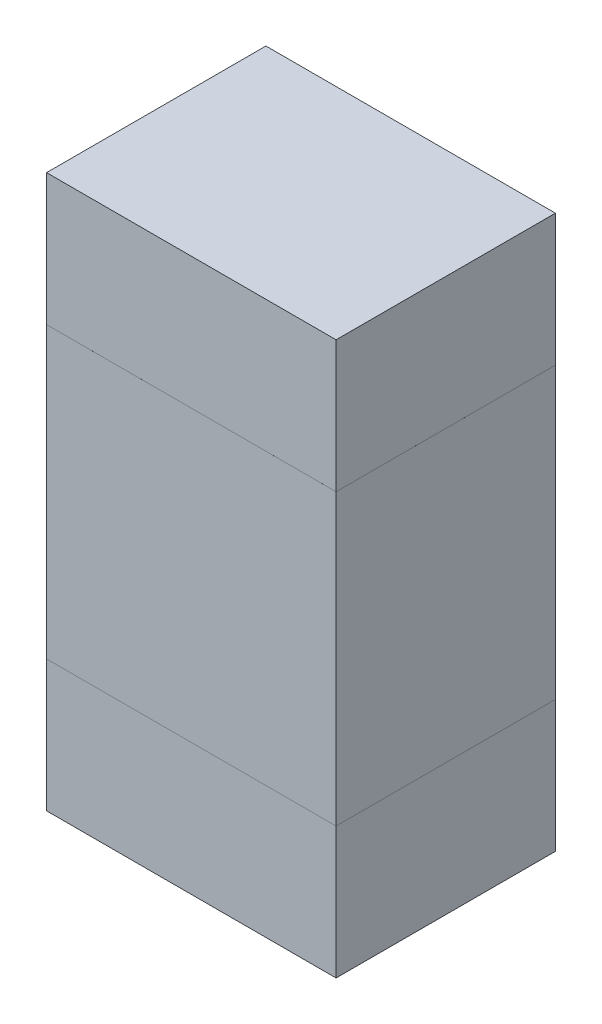
ISO-10303-21;
HEADER;
FILE_DESCRIPTION(('STEP AP214'),'2;1');
FILE_NAME('part.step','',(''),(''),'','','');
FILE_SCHEMA(('AUTOMOTIVE_DESIGN { 1 0 10303 214 1 1 1 1 }'));
ENDSEC;
DATA;
#1=APPLICATION_CONTEXT('core data for automotive mechanical design processes');
#2=APPLICATION_PROTOCOL_DEFINITION('international standard','automotive_design',2000,#1);
#3=PRODUCT_CONTEXT('',#1,'mechanical');
#4=PRODUCT('Part','Part','',(#3));
#5=PRODUCT_RELATED_PRODUCT_CATEGORY('part','',(#4));
#6=PRODUCT_DEFINITION_FORMATION('','',#4);
#7=PRODUCT_DEFINITION_CONTEXT('part definition',#1,'design');
#8=PRODUCT_DEFINITION('design','',#6,#7);
#9=PRODUCT_DEFINITION_SHAPE('','',#8);
#10=(LENGTH_UNIT() NAMED_UNIT(*) SI_UNIT(.MILLI.,.METRE.));
#11=(NAMED_UNIT(*) PLANE_ANGLE_UNIT() SI_UNIT($,.RADIAN.));
#12=(NAMED_UNIT(*) SI_UNIT($,.STERADIAN.) SOLID_ANGLE_UNIT());
#13=UNCERTAINTY_MEASURE_WITH_UNIT(LENGTH_MEASURE(1.E-05),#10,'distance_accuracy_value','');
#14=(GEOMETRIC_REPRESENTATION_CONTEXT(3) GLOBAL_UNCERTAINTY_ASSIGNED_CONTEXT((#13)) GLOBAL_UNIT_ASSIGNED_CONTEXT((#10,
#11,#12)) REPRESENTATION_CONTEXT('',''));
#15=CARTESIAN_POINT('',(0.,0.,0.));
#16=DIRECTION('',(0.,0.,1.));
#17=DIRECTION('',(1.,0.,0.));
#18=AXIS2_PLACEMENT_3D('',#15,#16,#17);
#19=CARTESIAN_POINT('',(5.340002521211,9.010001486074,0.2499995));
#20=DIRECTION('',(0.,0.,-1.));
#21=DIRECTION('',(0.,-1.,0.));
#22=AXIS2_PLACEMENT_3D('',#19,#20,#21);
#23=PLANE('',#22);
#24=DIRECTION('',(0.,1.,0.));
#25=VECTOR('',#24,1.);
#26=CARTESIAN_POINT('',(5.340002521211,9.010001486074,0.2499995));
#27=LINE('',#26,#25);
#28=CARTESIAN_POINT('',(5.340002521211,9.010001486074,0.2499995));
#29=VERTEX_POINT('',#28);
#30=CARTESIAN_POINT('',(5.340002521211,9.339998286074,0.2499995));
#31=VERTEX_POINT('',#30);
#32=EDGE_CURVE('P0_E94',#29,#31,#27,.T.);
#33=ORIENTED_EDGE('',*,*,#32,.T.);
#34=DIRECTION('',(-1.,0.,0.));
#35=VECTOR('',#34,1.);
#36=CARTESIAN_POINT('',(5.340002521211,9.339998286074,0.2499995));
#37=LINE('',#36,#35);
#38=CARTESIAN_POINT('',(5.010008261211,9.339998286074,0.2499995));
#39=VERTEX_POINT('',#38);
#40=EDGE_CURVE('P0_E90',#31,#39,#37,.T.);
#41=ORIENTED_EDGE('',*,*,#40,.T.);
#42=DIRECTION('',(0.,-1.,0.));
#43=VECTOR('',#42,1.);
#44=CARTESIAN_POINT('',(5.010008261211,9.339998286074,0.2499995));
#45=LINE('',#44,#43);
#46=CARTESIAN_POINT('',(5.010008261211,9.010001486074,0.2499995));
#47=VERTEX_POINT('',#46);
#48=EDGE_CURVE('P0_E114',#39,#47,#45,.T.);
#49=ORIENTED_EDGE('',*,*,#48,.T.);
#50=DIRECTION('',(1.,0.,0.));
#51=VECTOR('',#50,1.);
#52=CARTESIAN_POINT('',(5.010008261211,9.010001486074,0.2499995));
#53=LINE('',#52,#51);
#54=EDGE_CURVE('P0_E11',#47,#29,#53,.T.);
#55=ORIENTED_EDGE('',*,*,#54,.T.);
#56=EDGE_LOOP('',(#33,#41,#49,#55));
#57=FACE_BOUND('',#56,.T.);
#58=ADVANCED_FACE('P0_F17',(#57),#23,.F.);
#59=CARTESIAN_POINT('',(5.340002521211,9.010001486074,0.));
#60=DIRECTION('',(0.,0.,-1.));
#61=DIRECTION('',(0.,-1.,0.));
#62=AXIS2_PLACEMENT_3D('',#59,#60,#61);
#63=PLANE('',#62);
#64=DIRECTION('',(1.,0.,0.));
#65=VECTOR('',#64,1.);
#66=CARTESIAN_POINT('',(5.010008261211,9.010001486074,0.));
#67=LINE('',#66,#65);
#68=CARTESIAN_POINT('',(5.010008261211,9.010001486074,0.));
#69=VERTEX_POINT('',#68);
#70=CARTESIAN_POINT('',(5.340002521211,9.010001486074,0.));
#71=VERTEX_POINT('',#70);
#72=EDGE_CURVE('P0_E20',#69,#71,#67,.T.);
#73=ORIENTED_EDGE('',*,*,#72,.F.);
#74=DIRECTION('',(0.,-1.,0.));
#75=VECTOR('',#74,1.);
#76=CARTESIAN_POINT('',(5.010008261211,9.339998286074,0.));
#77=LINE('',#76,#75);
#78=CARTESIAN_POINT('',(5.010008261211,9.339998286074,0.));
#79=VERTEX_POINT('',#78);
#80=EDGE_CURVE('P0_E59',#79,#69,#77,.T.);
#81=ORIENTED_EDGE('',*,*,#80,.F.);
#82=DIRECTION('',(-1.,0.,0.));
#83=VECTOR('',#82,1.);
#84=CARTESIAN_POINT('',(5.340002521211,9.339998286074,0.));
#85=LINE('',#84,#83);
#86=CARTESIAN_POINT('',(5.340002521211,9.339998286074,0.));
#87=VERTEX_POINT('',#86);
#88=EDGE_CURVE('P0_E75',#87,#79,#85,.T.);
#89=ORIENTED_EDGE('',*,*,#88,.F.);
#90=DIRECTION('',(0.,1.,0.));
#91=VECTOR('',#90,1.);
#92=CARTESIAN_POINT('',(5.340002521211,9.010001486074,0.));
#93=LINE('',#92,#91);
#94=EDGE_CURVE('P0_E79',#71,#87,#93,.T.);
#95=ORIENTED_EDGE('',*,*,#94,.F.);
#96=EDGE_LOOP('',(#73,#81,#89,#95));
#97=FACE_BOUND('',#96,.T.);
#98=ADVANCED_FACE('P0_F77',(#97),#63,.T.);
#99=CARTESIAN_POINT('',(5.010008261211,9.010001486074,0.));
#100=DIRECTION('',(0.,1.,0.));
#101=DIRECTION('',(1.,0.,0.));
#102=AXIS2_PLACEMENT_3D('',#99,#100,#101);
#103=PLANE('',#102);
#104=ORIENTED_EDGE('',*,*,#72,.T.);
#105=DIRECTION('',(0.,0.,1.));
#106=VECTOR('',#105,1.);
#107=CARTESIAN_POINT('',(5.340002521211,9.010001486074,0.));
#108=LINE('',#107,#106);
#109=EDGE_CURVE('P0_E84',#71,#29,#108,.T.);
#110=ORIENTED_EDGE('',*,*,#109,.T.);
#111=ORIENTED_EDGE('',*,*,#54,.F.);
#112=DIRECTION('',(0.,0.,1.));
#113=VECTOR('',#112,1.);
#114=CARTESIAN_POINT('',(5.010008261211,9.010001486074,0.));
#115=LINE('',#114,#113);
#116=EDGE_CURVE('P0_E103',#69,#47,#115,.T.);
#117=ORIENTED_EDGE('',*,*,#116,.F.);
#118=EDGE_LOOP('',(#104,#110,#111,#117));
#119=FACE_BOUND('',#118,.T.);
#120=ADVANCED_FACE('P0_F122',(#119),#103,.F.);
#121=CARTESIAN_POINT('',(5.010008261211,9.339998286074,0.));
#122=DIRECTION('',(1.,0.,0.));
#123=DIRECTION('',(0.,1.,0.));
#124=AXIS2_PLACEMENT_3D('',#121,#122,#123);
#125=PLANE('',#124);
#126=ORIENTED_EDGE('',*,*,#80,.T.);
#127=ORIENTED_EDGE('',*,*,#116,.T.);
#128=ORIENTED_EDGE('',*,*,#48,.F.);
#129=DIRECTION('',(0.,0.,1.));
#130=VECTOR('',#129,1.);
#131=CARTESIAN_POINT('',(5.010008261211,9.339998286074,0.));
#132=LINE('',#131,#130);
#133=EDGE_CURVE('P0_E83',#79,#39,#132,.T.);
#134=ORIENTED_EDGE('',*,*,#133,.F.);
#135=EDGE_LOOP('',(#126,#127,#128,#134));
#136=FACE_BOUND('',#135,.T.);
#137=ADVANCED_FACE('P0_F121',(#136),#125,.F.);
#138=CARTESIAN_POINT('',(5.340002521211,9.339998286074,0.));
#139=DIRECTION('',(0.,-1.,0.));
#140=DIRECTION('',(0.,0.,-1.));
#141=AXIS2_PLACEMENT_3D('',#138,#139,#140);
#142=PLANE('',#141);
#143=ORIENTED_EDGE('',*,*,#88,.T.);
#144=ORIENTED_EDGE('',*,*,#133,.T.);
#145=ORIENTED_EDGE('',*,*,#40,.F.);
#146=DIRECTION('',(0.,0.,1.));
#147=VECTOR('',#146,1.);
#148=CARTESIAN_POINT('',(5.340002521211,9.339998286074,0.));
#149=LINE('',#148,#147);
#150=EDGE_CURVE('P0_E87',#87,#31,#149,.T.);
#151=ORIENTED_EDGE('',*,*,#150,.F.);
#152=EDGE_LOOP('',(#143,#144,#145,#151));
#153=FACE_BOUND('',#152,.T.);
#154=ADVANCED_FACE('P0_F88',(#153),#142,.F.);
#155=CARTESIAN_POINT('',(5.340002521211,9.010001486074,0.));
#156=DIRECTION('',(-1.,0.,0.));
#157=DIRECTION('',(0.,0.,1.));
#158=AXIS2_PLACEMENT_3D('',#155,#156,#157);
#159=PLANE('',#158);
#160=ORIENTED_EDGE('',*,*,#94,.T.);
#161=ORIENTED_EDGE('',*,*,#150,.T.);
#162=ORIENTED_EDGE('',*,*,#32,.F.);
#163=ORIENTED_EDGE('',*,*,#109,.F.);
#164=EDGE_LOOP('',(#160,#161,#162,#163));
#165=FACE_BOUND('',#164,.T.);
#166=ADVANCED_FACE('P0_F97',(#165),#159,.F.);
#167=CLOSED_SHELL('',(#58,#98,#120,#137,#154,#166));
#168=MANIFOLD_SOLID_BREP('P0_B1',#167);
#169=CARTESIAN_POINT('',(5.340002521211,9.490009039238,0.2499995));
#170=DIRECTION('',(0.,0.,-1.));
#171=DIRECTION('',(0.,-1.,0.));
#172=AXIS2_PLACEMENT_3D('',#169,#170,#171);
#173=PLANE('',#172);
#174=DIRECTION('',(-1.,0.,0.));
#175=VECTOR('',#174,1.);
#176=CARTESIAN_POINT('',(5.340002521211,9.490009039238,0.2499995));
#177=LINE('',#176,#175);
#178=CARTESIAN_POINT('',(5.340002521211,9.490009039238,0.2499995));
#179=VERTEX_POINT('',#178);
#180=CARTESIAN_POINT('',(5.010005721211,9.490009039238,0.2499995));
#181=VERTEX_POINT('',#180);
#182=EDGE_CURVE('P1_E77',#179,#181,#177,.T.);
#183=ORIENTED_EDGE('',*,*,#182,.T.);
#184=DIRECTION('',(0.,-1.,0.));
#185=VECTOR('',#184,1.);
#186=CARTESIAN_POINT('',(5.010005721211,9.490009039238,0.2499995));
#187=LINE('',#186,#185);
#188=CARTESIAN_POINT('',(5.010005721211,9.340001719238,0.2499995));
#189=VERTEX_POINT('',#188);
#190=EDGE_CURVE('P1_E75',#181,#189,#187,.T.);
#191=ORIENTED_EDGE('',*,*,#190,.T.);
#192=DIRECTION('',(1.,0.,0.));
#193=VECTOR('',#192,1.);
#194=CARTESIAN_POINT('',(5.010005721211,9.340001719238,0.2499995));
#195=LINE('',#194,#193);
#196=CARTESIAN_POINT('',(5.340002521211,9.340001719238,0.2499995));
#197=VERTEX_POINT('',#196);
#198=EDGE_CURVE('P1_E63',#189,#197,#195,.T.);
#199=ORIENTED_EDGE('',*,*,#198,.T.);
#200=DIRECTION('',(0.,1.,0.));
#201=VECTOR('',#200,1.);
#202=CARTESIAN_POINT('',(5.340002521211,9.340001719238,0.2499995));
#203=LINE('',#202,#201);
#204=EDGE_CURVE('P1_E11',#197,#179,#203,.T.);
#205=ORIENTED_EDGE('',*,*,#204,.T.);
#206=EDGE_LOOP('',(#183,#191,#199,#205));
#207=FACE_BOUND('',#206,.T.);
#208=ADVANCED_FACE('P1_F17',(#207),#173,.F.);
#209=CARTESIAN_POINT('',(5.340002521211,9.490009039238,0.));
#210=DIRECTION('',(0.,0.,-1.));
#211=DIRECTION('',(0.,-1.,0.));
#212=AXIS2_PLACEMENT_3D('',#209,#210,#211);
#213=PLANE('',#212);
#214=DIRECTION('',(0.,1.,0.));
#215=VECTOR('',#214,1.);
#216=CARTESIAN_POINT('',(5.340002521211,9.340001719238,0.));
#217=LINE('',#216,#215);
#218=CARTESIAN_POINT('',(5.340002521211,9.340001719238,0.));
#219=VERTEX_POINT('',#218);
#220=CARTESIAN_POINT('',(5.340002521211,9.490009039238,0.));
#221=VERTEX_POINT('',#220);
#222=EDGE_CURVE('P1_E26',#219,#221,#217,.T.);
#223=ORIENTED_EDGE('',*,*,#222,.F.);
#224=DIRECTION('',(1.,0.,0.));
#225=VECTOR('',#224,1.);
#226=CARTESIAN_POINT('',(5.010005721211,9.340001719238,0.));
#227=LINE('',#226,#225);
#228=CARTESIAN_POINT('',(5.010005721211,9.340001719238,0.));
#229=VERTEX_POINT('',#228);
#230=EDGE_CURVE('P1_E82',#229,#219,#227,.T.);
#231=ORIENTED_EDGE('',*,*,#230,.F.);
#232=DIRECTION('',(0.,-1.,0.));
#233=VECTOR('',#232,1.);
#234=CARTESIAN_POINT('',(5.010005721211,9.490009039238,0.));
#235=LINE('',#234,#233);
#236=CARTESIAN_POINT('',(5.010005721211,9.490009039238,0.));
#237=VERTEX_POINT('',#236);
#238=EDGE_CURVE('P1_E85',#237,#229,#235,.T.);
#239=ORIENTED_EDGE('',*,*,#238,.F.);
#240=DIRECTION('',(-1.,0.,0.));
#241=VECTOR('',#240,1.);
#242=CARTESIAN_POINT('',(5.340002521211,9.490009039238,0.));
#243=LINE('',#242,#241);
#244=EDGE_CURVE('P1_E107',#221,#237,#243,.T.);
#245=ORIENTED_EDGE('',*,*,#244,.F.);
#246=EDGE_LOOP('',(#223,#231,#239,#245));
#247=FACE_BOUND('',#246,.T.);
#248=ADVANCED_FACE('P1_F108',(#247),#213,.T.);
#249=CARTESIAN_POINT('',(5.340002521211,9.340001719238,0.));
#250=DIRECTION('',(-1.,0.,0.));
#251=DIRECTION('',(0.,0.,1.));
#252=AXIS2_PLACEMENT_3D('',#249,#250,#251);
#253=PLANE('',#252);
#254=ORIENTED_EDGE('',*,*,#222,.T.);
#255=DIRECTION('',(0.,0.,1.));
#256=VECTOR('',#255,1.);
#257=CARTESIAN_POINT('',(5.340002521211,9.490009039238,0.));
#258=LINE('',#257,#256);
#259=EDGE_CURVE('P1_E91',#221,#179,#258,.T.);
#260=ORIENTED_EDGE('',*,*,#259,.T.);
#261=ORIENTED_EDGE('',*,*,#204,.F.);
#262=DIRECTION('',(0.,0.,1.));
#263=VECTOR('',#262,1.);
#264=CARTESIAN_POINT('',(5.340002521211,9.340001719238,0.));
#265=LINE('',#264,#263);
#266=EDGE_CURVE('P1_E70',#219,#197,#265,.T.);
#267=ORIENTED_EDGE('',*,*,#266,.F.);
#268=EDGE_LOOP('',(#254,#260,#261,#267));
#269=FACE_BOUND('',#268,.T.);
#270=ADVANCED_FACE('P1_F101',(#269),#253,.F.);
#271=CARTESIAN_POINT('',(5.010005721211,9.340001719238,0.));
#272=DIRECTION('',(0.,1.,0.));
#273=DIRECTION('',(1.,0.,0.));
#274=AXIS2_PLACEMENT_3D('',#271,#272,#273);
#275=PLANE('',#274);
#276=ORIENTED_EDGE('',*,*,#230,.T.);
#277=ORIENTED_EDGE('',*,*,#266,.T.);
#278=ORIENTED_EDGE('',*,*,#198,.F.);
#279=DIRECTION('',(0.,0.,1.));
#280=VECTOR('',#279,1.);
#281=CARTESIAN_POINT('',(5.010005721211,9.340001719238,0.));
#282=LINE('',#281,#280);
#283=EDGE_CURVE('P1_E68',#229,#189,#282,.T.);
#284=ORIENTED_EDGE('',*,*,#283,.F.);
#285=EDGE_LOOP('',(#276,#277,#278,#284));
#286=FACE_BOUND('',#285,.T.);
#287=ADVANCED_FACE('P1_F66',(#286),#275,.F.);
#288=CARTESIAN_POINT('',(5.010005721211,9.490009039238,0.));
#289=DIRECTION('',(1.,0.,0.));
#290=DIRECTION('',(0.,1.,0.));
#291=AXIS2_PLACEMENT_3D('',#288,#289,#290);
#292=PLANE('',#291);
#293=ORIENTED_EDGE('',*,*,#238,.T.);
#294=ORIENTED_EDGE('',*,*,#283,.T.);
#295=ORIENTED_EDGE('',*,*,#190,.F.);
#296=DIRECTION('',(0.,0.,1.));
#297=VECTOR('',#296,1.);
#298=CARTESIAN_POINT('',(5.010005721211,9.490009039238,0.));
#299=LINE('',#298,#297);
#300=EDGE_CURVE('P1_E110',#237,#181,#299,.T.);
#301=ORIENTED_EDGE('',*,*,#300,.F.);
#302=EDGE_LOOP('',(#293,#294,#295,#301));
#303=FACE_BOUND('',#302,.T.);
#304=ADVANCED_FACE('P1_F84',(#303),#292,.F.);
#305=CARTESIAN_POINT('',(5.340002521211,9.490009039238,0.));
#306=DIRECTION('',(0.,-1.,0.));
#307=DIRECTION('',(0.,0.,-1.));
#308=AXIS2_PLACEMENT_3D('',#305,#306,#307);
#309=PLANE('',#308);
#310=ORIENTED_EDGE('',*,*,#244,.T.);
#311=ORIENTED_EDGE('',*,*,#300,.T.);
#312=ORIENTED_EDGE('',*,*,#182,.F.);
#313=ORIENTED_EDGE('',*,*,#259,.F.);
#314=EDGE_LOOP('',(#310,#311,#312,#313));
#315=FACE_BOUND('',#314,.T.);
#316=ADVANCED_FACE('P1_F106',(#315),#309,.F.);
#317=CLOSED_SHELL('',(#208,#248,#270,#287,#304,#316));
#318=MANIFOLD_SOLID_BREP('P1_B1',#317);
#319=CARTESIAN_POINT('',(5.340002521211,9.010005682305,0.2499995));
#320=DIRECTION('',(0.,0.,-1.));
#321=DIRECTION('',(0.,-1.,0.));
#322=AXIS2_PLACEMENT_3D('',#319,#320,#321);
#323=PLANE('',#322);
#324=DIRECTION('',(-1.,0.,0.));
#325=VECTOR('',#324,1.);
#326=CARTESIAN_POINT('',(5.340002521211,9.010005682305,0.2499995));
#327=LINE('',#326,#325);
#328=CARTESIAN_POINT('',(5.340002521211,9.010005682305,0.2499995));
#329=VERTEX_POINT('',#328);
#330=CARTESIAN_POINT('',(5.010005721211,9.010005682305,0.2499995));
#331=VERTEX_POINT('',#330);
#332=EDGE_CURVE('P2_E71',#329,#331,#327,.T.);
#333=ORIENTED_EDGE('',*,*,#332,.T.);
#334=DIRECTION('',(0.,-1.,0.));
#335=VECTOR('',#334,1.);
#336=CARTESIAN_POINT('',(5.010005721211,9.010005682305,0.2499995));
#337=LINE('',#336,#335);
#338=CARTESIAN_POINT('',(5.010005721211,8.859998362305,0.2499995));
#339=VERTEX_POINT('',#338);
#340=EDGE_CURVE('P2_E97',#331,#339,#337,.T.);
#341=ORIENTED_EDGE('',*,*,#340,.T.);
#342=DIRECTION('',(1.,0.,0.));
#343=VECTOR('',#342,1.);
#344=CARTESIAN_POINT('',(5.010005721211,8.859998362305,0.2499995));
#345=LINE('',#344,#343);
#346=CARTESIAN_POINT('',(5.340002521211,8.859998362305,0.2499995));
#347=VERTEX_POINT('',#346);
#348=EDGE_CURVE('P2_E73',#339,#347,#345,.T.);
#349=ORIENTED_EDGE('',*,*,#348,.T.);
#350=DIRECTION('',(0.,1.,0.));
#351=VECTOR('',#350,1.);
#352=CARTESIAN_POINT('',(5.340002521211,8.859998362305,0.2499995));
#353=LINE('',#352,#351);
#354=EDGE_CURVE('P2_E11',#347,#329,#353,.T.);
#355=ORIENTED_EDGE('',*,*,#354,.T.);
#356=EDGE_LOOP('',(#333,#341,#349,#355));
#357=FACE_BOUND('',#356,.T.);
#358=ADVANCED_FACE('P2_F17',(#357),#323,.F.);
#359=CARTESIAN_POINT('',(5.340002521211,9.010005682305,0.));
#360=DIRECTION('',(0.,0.,-1.));
#361=DIRECTION('',(0.,-1.,0.));
#362=AXIS2_PLACEMENT_3D('',#359,#360,#361);
#363=PLANE('',#362);
#364=DIRECTION('',(0.,1.,0.));
#365=VECTOR('',#364,1.);
#366=CARTESIAN_POINT('',(5.340002521211,8.859998362305,0.));
#367=LINE('',#366,#365);
#368=CARTESIAN_POINT('',(5.340002521211,8.859998362305,0.));
#369=VERTEX_POINT('',#368);
#370=CARTESIAN_POINT('',(5.340002521211,9.010005682305,0.));
#371=VERTEX_POINT('',#370);
#372=EDGE_CURVE('P2_E26',#369,#371,#367,.T.);
#373=ORIENTED_EDGE('',*,*,#372,.F.);
#374=DIRECTION('',(1.,0.,0.));
#375=VECTOR('',#374,1.);
#376=CARTESIAN_POINT('',(5.010005721211,8.859998362305,0.));
#377=LINE('',#376,#375);
#378=CARTESIAN_POINT('',(5.010005721211,8.859998362305,0.));
#379=VERTEX_POINT('',#378);
#380=EDGE_CURVE('P2_E99',#379,#369,#377,.T.);
#381=ORIENTED_EDGE('',*,*,#380,.F.);
#382=DIRECTION('',(0.,-1.,0.));
#383=VECTOR('',#382,1.);
#384=CARTESIAN_POINT('',(5.010005721211,9.010005682305,0.));
#385=LINE('',#384,#383);
#386=CARTESIAN_POINT('',(5.010005721211,9.010005682305,0.));
#387=VERTEX_POINT('',#386);
#388=EDGE_CURVE('P2_E81',#387,#379,#385,.T.);
#389=ORIENTED_EDGE('',*,*,#388,.F.);
#390=DIRECTION('',(-1.,0.,0.));
#391=VECTOR('',#390,1.);
#392=CARTESIAN_POINT('',(5.340002521211,9.010005682305,0.));
#393=LINE('',#392,#391);
#394=EDGE_CURVE('P2_E92',#371,#387,#393,.T.);
#395=ORIENTED_EDGE('',*,*,#394,.F.);
#396=EDGE_LOOP('',(#373,#381,#389,#395));
#397=FACE_BOUND('',#396,.T.);
#398=ADVANCED_FACE('P2_F19',(#397),#363,.T.);
#399=CARTESIAN_POINT('',(5.340002521211,8.859998362305,0.));
#400=DIRECTION('',(-1.,0.,0.));
#401=DIRECTION('',(0.,0.,1.));
#402=AXIS2_PLACEMENT_3D('',#399,#400,#401);
#403=PLANE('',#402);
#404=ORIENTED_EDGE('',*,*,#372,.T.);
#405=DIRECTION('',(0.,0.,1.));
#406=VECTOR('',#405,1.);
#407=CARTESIAN_POINT('',(5.340002521211,9.010005682305,0.));
#408=LINE('',#407,#406);
#409=EDGE_CURVE('P2_E76',#371,#329,#408,.T.);
#410=ORIENTED_EDGE('',*,*,#409,.T.);
#411=ORIENTED_EDGE('',*,*,#354,.F.);
#412=DIRECTION('',(0.,0.,1.));
#413=VECTOR('',#412,1.);
#414=CARTESIAN_POINT('',(5.340002521211,8.859998362305,0.));
#415=LINE('',#414,#413);
#416=EDGE_CURVE('P2_E104',#369,#347,#415,.T.);
#417=ORIENTED_EDGE('',*,*,#416,.F.);
#418=EDGE_LOOP('',(#404,#410,#411,#417));
#419=FACE_BOUND('',#418,.T.);
#420=ADVANCED_FACE('P2_F77',(#419),#403,.F.);
#421=CARTESIAN_POINT('',(5.010005721211,8.859998362305,0.));
#422=DIRECTION('',(0.,1.,0.));
#423=DIRECTION('',(1.,0.,0.));
#424=AXIS2_PLACEMENT_3D('',#421,#422,#423);
#425=PLANE('',#424);
#426=ORIENTED_EDGE('',*,*,#380,.T.);
#427=ORIENTED_EDGE('',*,*,#416,.T.);
#428=ORIENTED_EDGE('',*,*,#348,.F.);
#429=DIRECTION('',(0.,0.,1.));
#430=VECTOR('',#429,1.);
#431=CARTESIAN_POINT('',(5.010005721211,8.859998362305,0.));
#432=LINE('',#431,#430);
#433=EDGE_CURVE('P2_E100',#379,#339,#432,.T.);
#434=ORIENTED_EDGE('',*,*,#433,.F.);
#435=EDGE_LOOP('',(#426,#427,#428,#434));
#436=FACE_BOUND('',#435,.T.);
#437=ADVANCED_FACE('P2_F122',(#436),#425,.F.);
#438=CARTESIAN_POINT('',(5.010005721211,9.010005682305,0.));
#439=DIRECTION('',(1.,0.,0.));
#440=DIRECTION('',(0.,1.,0.));
#441=AXIS2_PLACEMENT_3D('',#438,#439,#440);
#442=PLANE('',#441);
#443=ORIENTED_EDGE('',*,*,#388,.T.);
#444=ORIENTED_EDGE('',*,*,#433,.T.);
#445=ORIENTED_EDGE('',*,*,#340,.F.);
#446=DIRECTION('',(0.,0.,1.));
#447=VECTOR('',#446,1.);
#448=CARTESIAN_POINT('',(5.010005721211,9.010005682305,0.));
#449=LINE('',#448,#447);
#450=EDGE_CURVE('P2_E85',#387,#331,#449,.T.);
#451=ORIENTED_EDGE('',*,*,#450,.F.);
#452=EDGE_LOOP('',(#443,#444,#445,#451));
#453=FACE_BOUND('',#452,.T.);
#454=ADVANCED_FACE('P2_F120',(#453),#442,.F.);
#455=CARTESIAN_POINT('',(5.340002521211,9.010005682305,0.));
#456=DIRECTION('',(0.,-1.,0.));
#457=DIRECTION('',(0.,0.,-1.));
#458=AXIS2_PLACEMENT_3D('',#455,#456,#457);
#459=PLANE('',#458);
#460=ORIENTED_EDGE('',*,*,#394,.T.);
#461=ORIENTED_EDGE('',*,*,#450,.T.);
#462=ORIENTED_EDGE('',*,*,#332,.F.);
#463=ORIENTED_EDGE('',*,*,#409,.F.);
#464=EDGE_LOOP('',(#460,#461,#462,#463));
#465=FACE_BOUND('',#464,.T.);
#466=ADVANCED_FACE('P2_F83',(#465),#459,.F.);
#467=CLOSED_SHELL('',(#358,#398,#420,#437,#454,#466));
#468=MANIFOLD_SOLID_BREP('P2_B1',#467);
#469=ADVANCED_BREP_SHAPE_REPRESENTATION('',(#18,#168,#318,#468),#14);
#470=SHAPE_DEFINITION_REPRESENTATION(#9,#469);
ENDSEC;
END-ISO-10303-21;
